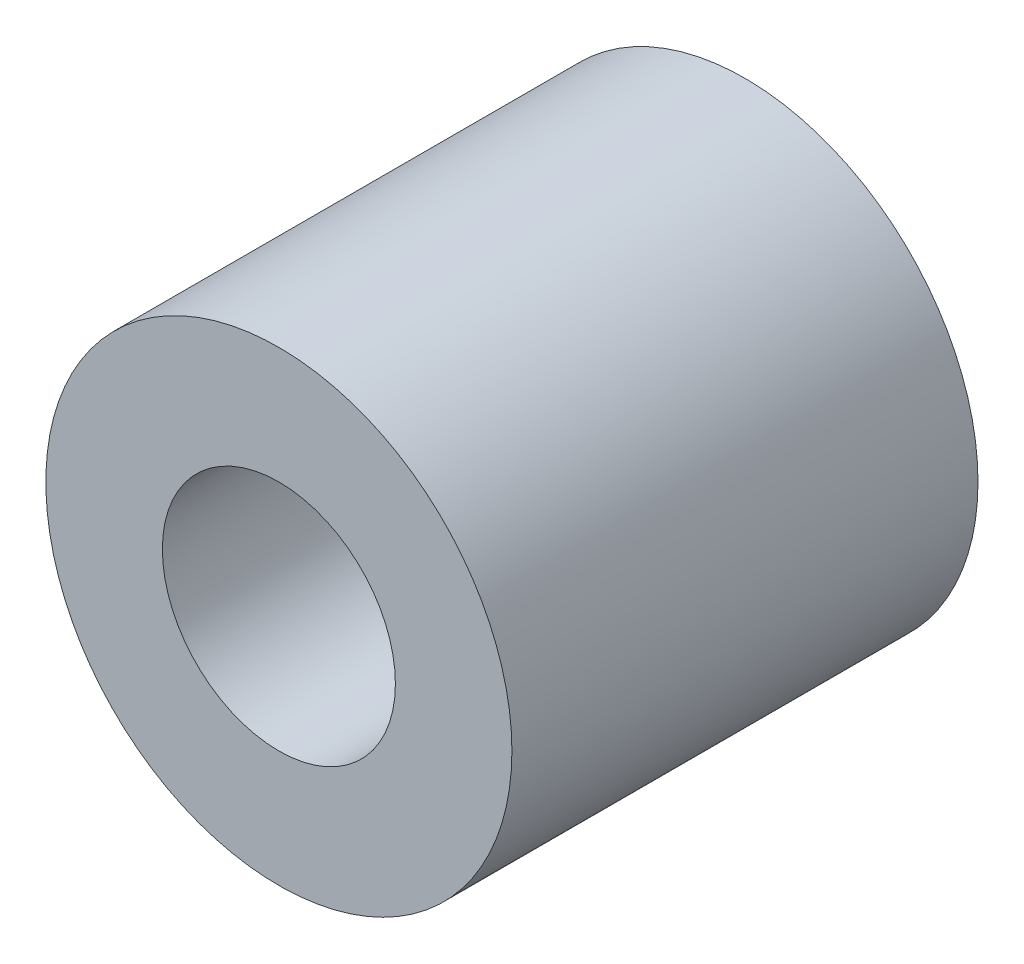
ISO-10303-21;
HEADER;
FILE_DESCRIPTION(('STEP AP214'),'2;1');
FILE_NAME('part.step','',(''),(''),'','','');
FILE_SCHEMA(('AUTOMOTIVE_DESIGN { 1 0 10303 214 1 1 1 1 }'));
ENDSEC;
DATA;
#1=APPLICATION_CONTEXT('core data for automotive mechanical design processes');
#2=APPLICATION_PROTOCOL_DEFINITION('international standard','automotive_design',2000,#1);
#3=PRODUCT_CONTEXT('',#1,'mechanical');
#4=PRODUCT('Part','Part','',(#3));
#5=PRODUCT_RELATED_PRODUCT_CATEGORY('part','',(#4));
#6=PRODUCT_DEFINITION_FORMATION('','',#4);
#7=PRODUCT_DEFINITION_CONTEXT('part definition',#1,'design');
#8=PRODUCT_DEFINITION('design','',#6,#7);
#9=PRODUCT_DEFINITION_SHAPE('','',#8);
#10=(LENGTH_UNIT() NAMED_UNIT(*) SI_UNIT(.MILLI.,.METRE.));
#11=(NAMED_UNIT(*) PLANE_ANGLE_UNIT() SI_UNIT($,.RADIAN.));
#12=(NAMED_UNIT(*) SI_UNIT($,.STERADIAN.) SOLID_ANGLE_UNIT());
#13=UNCERTAINTY_MEASURE_WITH_UNIT(LENGTH_MEASURE(1.E-05),#10,'distance_accuracy_value','');
#14=(GEOMETRIC_REPRESENTATION_CONTEXT(3) GLOBAL_UNCERTAINTY_ASSIGNED_CONTEXT((#13)) GLOBAL_UNIT_ASSIGNED_CONTEXT((#10,
#11,#12)) REPRESENTATION_CONTEXT('',''));
#15=CARTESIAN_POINT('',(0.,0.,0.));
#16=DIRECTION('',(0.,0.,1.));
#17=DIRECTION('',(1.,0.,0.));
#18=AXIS2_PLACEMENT_3D('',#15,#16,#17);
#19=CARTESIAN_POINT('',(0.,0.,12.));
#20=DIRECTION('',(0.,0.,1.));
#21=DIRECTION('',(1.,0.,0.));
#22=AXIS2_PLACEMENT_3D('',#19,#20,#21);
#23=PLANE('',#22);
#24=CARTESIAN_POINT('',(0.,0.,12.));
#25=DIRECTION('',(0.,0.,1.));
#26=DIRECTION('',(1.,0.,0.));
#27=AXIS2_PLACEMENT_3D('',#24,#25,#26);
#28=CIRCLE('',#27,6.);
#29=CARTESIAN_POINT('',(6.,0.,12.));
#30=VERTEX_POINT('',#29);
#31=EDGE_CURVE('E10',#30,#30,#28,.T.);
#32=ORIENTED_EDGE('',*,*,#31,.T.);
#33=EDGE_LOOP('',(#32));
#34=FACE_BOUND('',#33,.T.);
#35=CARTESIAN_POINT('',(0.,0.,12.));
#36=DIRECTION('',(0.,0.,1.));
#37=DIRECTION('',(1.,0.,0.));
#38=AXIS2_PLACEMENT_3D('',#35,#36,#37);
#39=CIRCLE('',#38,3.);
#40=CARTESIAN_POINT('',(3.,0.,12.));
#41=VERTEX_POINT('',#40);
#42=EDGE_CURVE('E44',#41,#41,#39,.T.);
#43=ORIENTED_EDGE('',*,*,#42,.F.);
#44=EDGE_LOOP('',(#43));
#45=FACE_BOUND('',#44,.T.);
#46=ADVANCED_FACE('F33',(#34,#45),#23,.T.);
#47=CARTESIAN_POINT('',(0.,0.,0.));
#48=DIRECTION('',(0.,0.,1.));
#49=DIRECTION('',(1.,0.,0.));
#50=AXIS2_PLACEMENT_3D('',#47,#48,#49);
#51=PLANE('',#50);
#52=CARTESIAN_POINT('',(0.,0.,0.));
#53=DIRECTION('',(0.,0.,1.));
#54=DIRECTION('',(1.,0.,0.));
#55=AXIS2_PLACEMENT_3D('',#52,#53,#54);
#56=CIRCLE('',#55,6.);
#57=CARTESIAN_POINT('',(6.,0.,0.));
#58=VERTEX_POINT('',#57);
#59=EDGE_CURVE('E37',#58,#58,#56,.T.);
#60=ORIENTED_EDGE('',*,*,#59,.F.);
#61=EDGE_LOOP('',(#60));
#62=FACE_BOUND('',#61,.T.);
#63=CARTESIAN_POINT('',(0.,0.,0.));
#64=DIRECTION('',(0.,0.,1.));
#65=DIRECTION('',(1.,0.,0.));
#66=AXIS2_PLACEMENT_3D('',#63,#64,#65);
#67=CIRCLE('',#66,3.);
#68=CARTESIAN_POINT('',(3.,0.,0.));
#69=VERTEX_POINT('',#68);
#70=EDGE_CURVE('E46',#69,#69,#67,.T.);
#71=ORIENTED_EDGE('',*,*,#70,.T.);
#72=EDGE_LOOP('',(#71));
#73=FACE_BOUND('',#72,.T.);
#74=ADVANCED_FACE('F56',(#62,#73),#51,.F.);
#75=CARTESIAN_POINT('',(0.,0.,12.));
#76=DIRECTION('',(0.,0.,-1.));
#77=DIRECTION('',(-1.,0.,0.));
#78=AXIS2_PLACEMENT_3D('',#75,#76,#77);
#79=CYLINDRICAL_SURFACE('',#78,6.);
#80=ORIENTED_EDGE('',*,*,#31,.F.);
#81=EDGE_LOOP('',(#80));
#82=FACE_BOUND('',#81,.T.);
#83=ORIENTED_EDGE('',*,*,#59,.T.);
#84=EDGE_LOOP('',(#83));
#85=FACE_BOUND('',#84,.T.);
#86=ADVANCED_FACE('F35',(#82,#85),#79,.T.);
#87=CARTESIAN_POINT('',(0.,0.,12.));
#88=DIRECTION('',(0.,0.,-1.));
#89=DIRECTION('',(-1.,0.,0.));
#90=AXIS2_PLACEMENT_3D('',#87,#88,#89);
#91=CYLINDRICAL_SURFACE('',#90,3.);
#92=ORIENTED_EDGE('',*,*,#42,.T.);
#93=EDGE_LOOP('',(#92));
#94=FACE_BOUND('',#93,.T.);
#95=ORIENTED_EDGE('',*,*,#70,.F.);
#96=EDGE_LOOP('',(#95));
#97=FACE_BOUND('',#96,.T.);
#98=ADVANCED_FACE('F52',(#94,#97),#91,.F.);
#99=CLOSED_SHELL('',(#46,#74,#86,#98));
#100=MANIFOLD_SOLID_BREP('B2',#99);
#101=ADVANCED_BREP_SHAPE_REPRESENTATION('',(#18,#100),#14);
#102=SHAPE_DEFINITION_REPRESENTATION(#9,#101);
ENDSEC;
END-ISO-10303-21;
